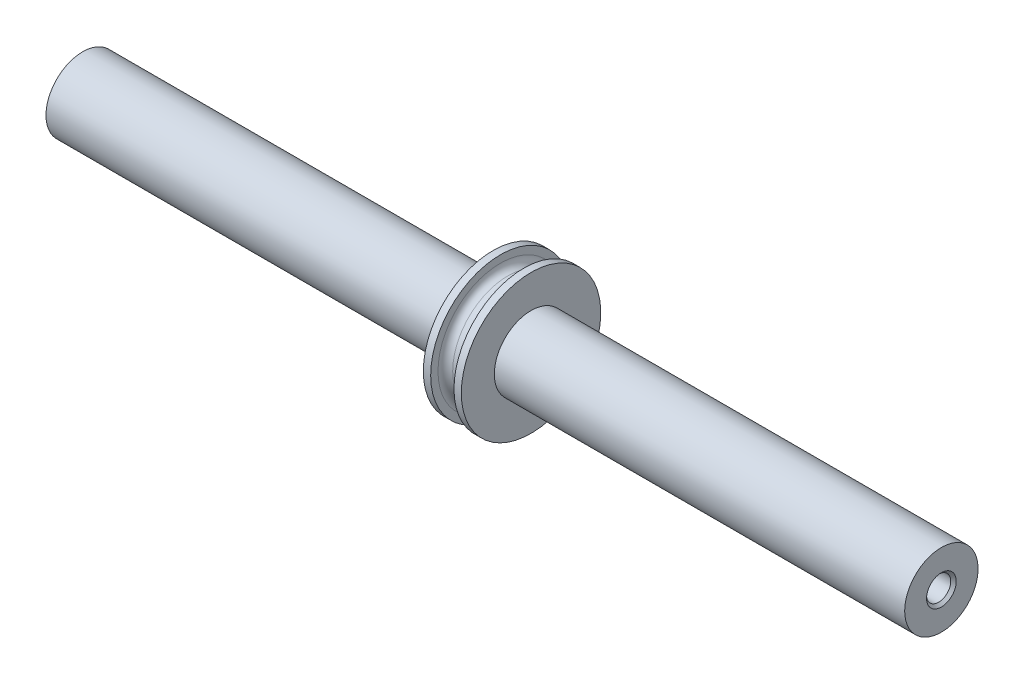
ISO-10303-21;
HEADER;
FILE_DESCRIPTION(('STEP AP214'),'2;1');
FILE_NAME('part.step','',(''),(''),'','','');
FILE_SCHEMA(('AUTOMOTIVE_DESIGN { 1 0 10303 214 1 1 1 1 }'));
ENDSEC;
DATA;
#1=APPLICATION_CONTEXT('core data for automotive mechanical design processes');
#2=APPLICATION_PROTOCOL_DEFINITION('international standard','automotive_design',2000,#1);
#3=PRODUCT_CONTEXT('',#1,'mechanical');
#4=PRODUCT('Part','Part','',(#3));
#5=PRODUCT_RELATED_PRODUCT_CATEGORY('part','',(#4));
#6=PRODUCT_DEFINITION_FORMATION('','',#4);
#7=PRODUCT_DEFINITION_CONTEXT('part definition',#1,'design');
#8=PRODUCT_DEFINITION('design','',#6,#7);
#9=PRODUCT_DEFINITION_SHAPE('','',#8);
#10=(LENGTH_UNIT() NAMED_UNIT(*) SI_UNIT(.MILLI.,.METRE.));
#11=(NAMED_UNIT(*) PLANE_ANGLE_UNIT() SI_UNIT($,.RADIAN.));
#12=(NAMED_UNIT(*) SI_UNIT($,.STERADIAN.) SOLID_ANGLE_UNIT());
#13=UNCERTAINTY_MEASURE_WITH_UNIT(LENGTH_MEASURE(1.E-05),#10,'distance_accuracy_value','');
#14=(GEOMETRIC_REPRESENTATION_CONTEXT(3) GLOBAL_UNCERTAINTY_ASSIGNED_CONTEXT((#13)) GLOBAL_UNIT_ASSIGNED_CONTEXT((#10,
#11,#12)) REPRESENTATION_CONTEXT('',''));
#15=CARTESIAN_POINT('',(0.,0.,0.));
#16=DIRECTION('',(0.,0.,1.));
#17=DIRECTION('',(1.,0.,0.));
#18=AXIS2_PLACEMENT_3D('',#15,#16,#17);
#19=CARTESIAN_POINT('',(-2.5875,0.,0.));
#20=DIRECTION('',(-1.,0.,0.));
#21=DIRECTION('',(0.,0.,1.));
#22=AXIS2_PLACEMENT_3D('',#19,#20,#21);
#23=PLANE('',#22);
#24=CARTESIAN_POINT('',(-2.5875,0.,0.));
#25=DIRECTION('',(-1.,0.,0.));
#26=DIRECTION('',(0.,0.,1.));
#27=AXIS2_PLACEMENT_3D('',#24,#25,#26);
#28=CIRCLE('',#27,9.5);
#29=CARTESIAN_POINT('',(-2.5875,0.,9.5));
#30=VERTEX_POINT('',#29);
#31=EDGE_CURVE('E89',#30,#30,#28,.T.);
#32=ORIENTED_EDGE('',*,*,#31,.T.);
#33=EDGE_LOOP('',(#32));
#34=FACE_BOUND('',#33,.T.);
#35=CARTESIAN_POINT('',(-2.5875,0.,0.));
#36=DIRECTION('',(-1.,0.,0.));
#37=DIRECTION('',(0.,0.,1.));
#38=AXIS2_PLACEMENT_3D('',#35,#36,#37);
#39=CIRCLE('',#38,5.);
#40=CARTESIAN_POINT('',(-2.5875,0.,5.));
#41=VERTEX_POINT('',#40);
#42=EDGE_CURVE('E110',#41,#41,#39,.T.);
#43=ORIENTED_EDGE('',*,*,#42,.F.);
#44=EDGE_LOOP('',(#43));
#45=FACE_BOUND('',#44,.T.);
#46=ADVANCED_FACE('F49',(#34,#45),#23,.T.);
#47=CARTESIAN_POINT('',(-2.64679019420622,0.,0.));
#48=DIRECTION('',(-1.,0.,0.));
#49=DIRECTION('',(0.,0.,1.));
#50=AXIS2_PLACEMENT_3D('',#47,#48,#49);
#51=CYLINDRICAL_SURFACE('',#50,5.);
#52=CARTESIAN_POINT('',(-58.5,0.,0.));
#53=DIRECTION('',(-1.,0.,0.));
#54=DIRECTION('',(0.,0.,1.));
#55=AXIS2_PLACEMENT_3D('',#52,#53,#54);
#56=CIRCLE('',#55,4.99999999999999);
#57=CARTESIAN_POINT('',(-58.5,0.,4.99999999999999));
#58=VERTEX_POINT('',#57);
#59=EDGE_CURVE('E107',#58,#58,#56,.T.);
#60=ORIENTED_EDGE('',*,*,#59,.F.);
#61=EDGE_LOOP('',(#60));
#62=FACE_BOUND('',#61,.T.);
#63=ORIENTED_EDGE('',*,*,#42,.T.);
#64=EDGE_LOOP('',(#63));
#65=FACE_BOUND('',#64,.T.);
#66=ADVANCED_FACE('F155',(#62,#65),#51,.T.);
#67=CARTESIAN_POINT('',(-58.5,0.,0.));
#68=DIRECTION('',(-1.,0.,0.));
#69=DIRECTION('',(0.,0.,1.));
#70=AXIS2_PLACEMENT_3D('',#67,#68,#69);
#71=PLANE('',#70);
#72=CARTESIAN_POINT('',(-58.5,0.,0.));
#73=DIRECTION('',(-1.,0.,0.));
#74=DIRECTION('',(0.,0.,1.));
#75=AXIS2_PLACEMENT_3D('',#72,#73,#74);
#76=CIRCLE('',#75,2.025);
#77=CARTESIAN_POINT('',(-58.5,0.,2.025));
#78=VERTEX_POINT('',#77);
#79=EDGE_CURVE('E73',#78,#78,#76,.T.);
#80=ORIENTED_EDGE('',*,*,#79,.F.);
#81=EDGE_LOOP('',(#80));
#82=FACE_BOUND('',#81,.T.);
#83=ORIENTED_EDGE('',*,*,#59,.T.);
#84=EDGE_LOOP('',(#83));
#85=FACE_BOUND('',#84,.T.);
#86=ADVANCED_FACE('F161',(#82,#85),#71,.T.);
#87=CARTESIAN_POINT('',(58.5,0.,0.));
#88=DIRECTION('',(-1.,0.,0.));
#89=DIRECTION('',(0.,0.,1.));
#90=AXIS2_PLACEMENT_3D('',#87,#88,#89);
#91=PLANE('',#90);
#92=CARTESIAN_POINT('',(58.5,0.,0.));
#93=DIRECTION('',(-1.,0.,0.));
#94=DIRECTION('',(0.,0.,1.));
#95=AXIS2_PLACEMENT_3D('',#92,#93,#94);
#96=CIRCLE('',#95,2.025);
#97=CARTESIAN_POINT('',(58.5,0.,2.025));
#98=VERTEX_POINT('',#97);
#99=EDGE_CURVE('E80',#98,#98,#96,.T.);
#100=ORIENTED_EDGE('',*,*,#99,.T.);
#101=EDGE_LOOP('',(#100));
#102=FACE_BOUND('',#101,.T.);
#103=CARTESIAN_POINT('',(58.5,0.,0.));
#104=DIRECTION('',(-1.,0.,0.));
#105=DIRECTION('',(0.,0.,1.));
#106=AXIS2_PLACEMENT_3D('',#103,#104,#105);
#107=CIRCLE('',#106,4.99999999999999);
#108=CARTESIAN_POINT('',(58.5,0.,4.99999999999999));
#109=VERTEX_POINT('',#108);
#110=EDGE_CURVE('E104',#109,#109,#107,.T.);
#111=ORIENTED_EDGE('',*,*,#110,.F.);
#112=EDGE_LOOP('',(#111));
#113=FACE_BOUND('',#112,.T.);
#114=ADVANCED_FACE('F168',(#102,#113),#91,.F.);
#115=CARTESIAN_POINT('',(-2.64679019420622,0.,0.));
#116=DIRECTION('',(-1.,0.,0.));
#117=DIRECTION('',(0.,0.,1.));
#118=AXIS2_PLACEMENT_3D('',#115,#116,#117);
#119=CYLINDRICAL_SURFACE('',#118,4.99999999999999);
#120=ORIENTED_EDGE('',*,*,#110,.T.);
#121=EDGE_LOOP('',(#120));
#122=FACE_BOUND('',#121,.T.);
#123=CARTESIAN_POINT('',(2.5875,0.,0.));
#124=DIRECTION('',(-1.,0.,0.));
#125=DIRECTION('',(0.,0.,1.));
#126=AXIS2_PLACEMENT_3D('',#123,#124,#125);
#127=CIRCLE('',#126,5.);
#128=CARTESIAN_POINT('',(2.5875,0.,5.));
#129=VERTEX_POINT('',#128);
#130=EDGE_CURVE('E101',#129,#129,#127,.T.);
#131=ORIENTED_EDGE('',*,*,#130,.F.);
#132=EDGE_LOOP('',(#131));
#133=FACE_BOUND('',#132,.T.);
#134=ADVANCED_FACE('F172',(#122,#133),#119,.T.);
#135=CARTESIAN_POINT('',(2.5875,0.,0.));
#136=DIRECTION('',(-1.,0.,0.));
#137=DIRECTION('',(0.,0.,1.));
#138=AXIS2_PLACEMENT_3D('',#135,#136,#137);
#139=PLANE('',#138);
#140=CARTESIAN_POINT('',(2.5875,0.,0.));
#141=DIRECTION('',(-1.,0.,0.));
#142=DIRECTION('',(0.,0.,1.));
#143=AXIS2_PLACEMENT_3D('',#140,#141,#142);
#144=CIRCLE('',#143,9.5);
#145=CARTESIAN_POINT('',(2.5875,0.,9.5));
#146=VERTEX_POINT('',#145);
#147=EDGE_CURVE('E98',#146,#146,#144,.T.);
#148=ORIENTED_EDGE('',*,*,#147,.F.);
#149=EDGE_LOOP('',(#148));
#150=FACE_BOUND('',#149,.T.);
#151=ORIENTED_EDGE('',*,*,#130,.T.);
#152=EDGE_LOOP('',(#151));
#153=FACE_BOUND('',#152,.T.);
#154=ADVANCED_FACE('F176',(#150,#153),#139,.F.);
#155=CARTESIAN_POINT('',(-2.64679019420622,0.,0.));
#156=DIRECTION('',(-1.,0.,0.));
#157=DIRECTION('',(0.,0.,1.));
#158=AXIS2_PLACEMENT_3D('',#155,#156,#157);
#159=CYLINDRICAL_SURFACE('',#158,9.5);
#160=ORIENTED_EDGE('',*,*,#147,.T.);
#161=EDGE_LOOP('',(#160));
#162=FACE_BOUND('',#161,.T.);
#163=CARTESIAN_POINT('',(1.5875,0.,0.));
#164=DIRECTION('',(-1.,0.,0.));
#165=DIRECTION('',(0.,0.,1.));
#166=AXIS2_PLACEMENT_3D('',#163,#164,#165);
#167=CIRCLE('',#166,9.5);
#168=CARTESIAN_POINT('',(1.5875,0.,9.5));
#169=VERTEX_POINT('',#168);
#170=EDGE_CURVE('E95',#169,#169,#167,.T.);
#171=ORIENTED_EDGE('',*,*,#170,.F.);
#172=EDGE_LOOP('',(#171));
#173=FACE_BOUND('',#172,.T.);
#174=ADVANCED_FACE('F180',(#162,#173),#159,.T.);
#175=CARTESIAN_POINT('',(1.5875,0.,0.));
#176=DIRECTION('',(-1.,0.,0.));
#177=DIRECTION('',(0.,0.,1.));
#178=AXIS2_PLACEMENT_3D('',#175,#176,#177);
#179=PLANE('',#178);
#180=CARTESIAN_POINT('',(1.5875,0.,0.));
#181=DIRECTION('',(-1.,0.,0.));
#182=DIRECTION('',(0.,0.,1.));
#183=AXIS2_PLACEMENT_3D('',#180,#181,#182);
#184=CIRCLE('',#183,8.5);
#185=CARTESIAN_POINT('',(1.5875,0.,8.5));
#186=VERTEX_POINT('',#185);
#187=EDGE_CURVE('E57',#186,#186,#184,.F.);
#188=ORIENTED_EDGE('',*,*,#187,.T.);
#189=EDGE_LOOP('',(#188));
#190=FACE_BOUND('',#189,.T.);
#191=ORIENTED_EDGE('',*,*,#170,.T.);
#192=EDGE_LOOP('',(#191));
#193=FACE_BOUND('',#192,.T.);
#194=ADVANCED_FACE('F121',(#190,#193),#179,.T.);
#195=CARTESIAN_POINT('',(-2.64679019420622,0.,0.));
#196=DIRECTION('',(-1.,0.,0.));
#197=DIRECTION('',(0.,0.,1.));
#198=AXIS2_PLACEMENT_3D('',#195,#196,#197);
#199=CYLINDRICAL_SURFACE('',#198,7.5);
#200=CARTESIAN_POINT('',(0.5875,0.,0.));
#201=DIRECTION('',(-1.,0.,0.));
#202=DIRECTION('',(0.,0.,1.));
#203=AXIS2_PLACEMENT_3D('',#200,#201,#202);
#204=CIRCLE('',#203,7.5);
#205=CARTESIAN_POINT('',(0.5875,0.,7.5));
#206=VERTEX_POINT('',#205);
#207=EDGE_CURVE('E116',#206,#206,#204,.T.);
#208=ORIENTED_EDGE('',*,*,#207,.T.);
#209=EDGE_LOOP('',(#208));
#210=FACE_BOUND('',#209,.T.);
#211=CARTESIAN_POINT('',(-0.5875,0.,0.));
#212=DIRECTION('',(-1.,0.,0.));
#213=DIRECTION('',(0.,0.,1.));
#214=AXIS2_PLACEMENT_3D('',#211,#212,#213);
#215=CIRCLE('',#214,7.5);
#216=CARTESIAN_POINT('',(-0.5875,0.,7.5));
#217=VERTEX_POINT('',#216);
#218=EDGE_CURVE('E113',#217,#217,#215,.F.);
#219=ORIENTED_EDGE('',*,*,#218,.T.);
#220=EDGE_LOOP('',(#219));
#221=FACE_BOUND('',#220,.T.);
#222=ADVANCED_FACE('F130',(#210,#221),#199,.T.);
#223=CARTESIAN_POINT('',(-1.5875,0.,0.));
#224=DIRECTION('',(-1.,0.,0.));
#225=DIRECTION('',(0.,0.,1.));
#226=AXIS2_PLACEMENT_3D('',#223,#224,#225);
#227=PLANE('',#226);
#228=CARTESIAN_POINT('',(-1.5875,0.,0.));
#229=DIRECTION('',(-1.,0.,0.));
#230=DIRECTION('',(0.,0.,1.));
#231=AXIS2_PLACEMENT_3D('',#228,#229,#230);
#232=CIRCLE('',#231,8.5);
#233=CARTESIAN_POINT('',(-1.5875,0.,8.5));
#234=VERTEX_POINT('',#233);
#235=EDGE_CURVE('E11',#234,#234,#232,.T.);
#236=ORIENTED_EDGE('',*,*,#235,.T.);
#237=EDGE_LOOP('',(#236));
#238=FACE_BOUND('',#237,.T.);
#239=CARTESIAN_POINT('',(-1.5875,0.,0.));
#240=DIRECTION('',(-1.,0.,0.));
#241=DIRECTION('',(0.,0.,1.));
#242=AXIS2_PLACEMENT_3D('',#239,#240,#241);
#243=CIRCLE('',#242,9.5);
#244=CARTESIAN_POINT('',(-1.5875,0.,9.5));
#245=VERTEX_POINT('',#244);
#246=EDGE_CURVE('E92',#245,#245,#243,.T.);
#247=ORIENTED_EDGE('',*,*,#246,.F.);
#248=EDGE_LOOP('',(#247));
#249=FACE_BOUND('',#248,.T.);
#250=ADVANCED_FACE('F133',(#238,#249),#227,.F.);
#251=CARTESIAN_POINT('',(-2.64679019420622,0.,0.));
#252=DIRECTION('',(-1.,0.,0.));
#253=DIRECTION('',(0.,0.,1.));
#254=AXIS2_PLACEMENT_3D('',#251,#252,#253);
#255=CYLINDRICAL_SURFACE('',#254,9.5);
#256=ORIENTED_EDGE('',*,*,#31,.F.);
#257=EDGE_LOOP('',(#256));
#258=FACE_BOUND('',#257,.T.);
#259=ORIENTED_EDGE('',*,*,#246,.T.);
#260=EDGE_LOOP('',(#259));
#261=FACE_BOUND('',#260,.T.);
#262=ADVANCED_FACE('F127',(#258,#261),#255,.T.);
#263=CARTESIAN_POINT('',(0.5875,0.,0.));
#264=DIRECTION('',(-1.,0.,0.));
#265=DIRECTION('',(0.,0.,1.));
#266=AXIS2_PLACEMENT_3D('',#263,#264,#265);
#267=TOROIDAL_SURFACE('',#266,8.5,1.);
#268=ORIENTED_EDGE('',*,*,#187,.F.);
#269=EDGE_LOOP('',(#268));
#270=FACE_BOUND('',#269,.T.);
#271=ORIENTED_EDGE('',*,*,#207,.F.);
#272=EDGE_LOOP('',(#271));
#273=FACE_BOUND('',#272,.T.);
#274=ADVANCED_FACE('F124',(#270,#273),#267,.F.);
#275=CARTESIAN_POINT('',(-0.5875,0.,0.));
#276=DIRECTION('',(-1.,0.,0.));
#277=DIRECTION('',(0.,0.,1.));
#278=AXIS2_PLACEMENT_3D('',#275,#276,#277);
#279=TOROIDAL_SURFACE('',#278,8.5,1.);
#280=ORIENTED_EDGE('',*,*,#218,.F.);
#281=EDGE_LOOP('',(#280));
#282=FACE_BOUND('',#281,.T.);
#283=ORIENTED_EDGE('',*,*,#235,.F.);
#284=EDGE_LOOP('',(#283));
#285=FACE_BOUND('',#284,.T.);
#286=ADVANCED_FACE('F51',(#282,#285),#279,.F.);
#287=CARTESIAN_POINT('',(-43.5,0.,0.));
#288=DIRECTION('',(-1.,0.,0.));
#289=DIRECTION('',(0.,0.,1.));
#290=AXIS2_PLACEMENT_3D('',#287,#288,#289);
#291=CONICAL_SURFACE('',#290,1.65,1.02974425867665);
#292=CARTESIAN_POINT('',(-42.5085799786045,0.,0.));
#293=VERTEX_POINT('',#292);
#294=VERTEX_LOOP('',#293);
#295=FACE_BOUND('',#294,.T.);
#296=CARTESIAN_POINT('',(-43.5,0.,0.));
#297=DIRECTION('',(-1.,0.,0.));
#298=DIRECTION('',(0.,0.,1.));
#299=AXIS2_PLACEMENT_3D('',#296,#297,#298);
#300=CIRCLE('',#299,1.65);
#301=CARTESIAN_POINT('',(-43.5,0.,1.65));
#302=VERTEX_POINT('',#301);
#303=EDGE_CURVE('E86',#302,#302,#300,.T.);
#304=ORIENTED_EDGE('',*,*,#303,.T.);
#305=EDGE_LOOP('',(#304));
#306=FACE_BOUND('',#305,.T.);
#307=ADVANCED_FACE('F139',(#295,#306),#291,.F.);
#308=CARTESIAN_POINT('',(-58.5,0.,0.));
#309=DIRECTION('',(-1.,0.,0.));
#310=DIRECTION('',(0.,0.,1.));
#311=AXIS2_PLACEMENT_3D('',#308,#309,#310);
#312=CYLINDRICAL_SURFACE('',#311,1.65);
#313=ORIENTED_EDGE('',*,*,#303,.F.);
#314=EDGE_LOOP('',(#313));
#315=FACE_BOUND('',#314,.T.);
#316=CARTESIAN_POINT('',(-58.125,0.,0.));
#317=DIRECTION('',(-1.,0.,0.));
#318=DIRECTION('',(0.,0.,1.));
#319=AXIS2_PLACEMENT_3D('',#316,#317,#318);
#320=CIRCLE('',#319,1.65);
#321=CARTESIAN_POINT('',(-58.125,0.,1.65));
#322=VERTEX_POINT('',#321);
#323=EDGE_CURVE('E77',#322,#322,#320,.T.);
#324=ORIENTED_EDGE('',*,*,#323,.T.);
#325=EDGE_LOOP('',(#324));
#326=FACE_BOUND('',#325,.T.);
#327=ADVANCED_FACE('F235',(#315,#326),#312,.F.);
#328=CARTESIAN_POINT('',(-58.5,0.,0.));
#329=DIRECTION('',(-1.,0.,0.));
#330=DIRECTION('',(0.,0.,1.));
#331=AXIS2_PLACEMENT_3D('',#328,#329,#330);
#332=CONICAL_SURFACE('',#331,2.025,0.78539816339745);
#333=ORIENTED_EDGE('',*,*,#323,.F.);
#334=EDGE_LOOP('',(#333));
#335=FACE_BOUND('',#334,.T.);
#336=ORIENTED_EDGE('',*,*,#79,.T.);
#337=EDGE_LOOP('',(#336));
#338=FACE_BOUND('',#337,.T.);
#339=ADVANCED_FACE('F67',(#335,#338),#332,.F.);
#340=CARTESIAN_POINT('',(43.5,0.,0.));
#341=DIRECTION('',(1.,0.,0.));
#342=DIRECTION('',(0.,0.,1.));
#343=AXIS2_PLACEMENT_3D('',#340,#341,#342);
#344=CONICAL_SURFACE('',#343,1.65,1.02974425867665);
#345=CARTESIAN_POINT('',(42.5085799786045,0.,0.));
#346=VERTEX_POINT('',#345);
#347=VERTEX_LOOP('',#346);
#348=FACE_BOUND('',#347,.T.);
#349=CARTESIAN_POINT('',(43.5,0.,0.));
#350=DIRECTION('',(-1.,0.,0.));
#351=DIRECTION('',(0.,0.,1.));
#352=AXIS2_PLACEMENT_3D('',#349,#350,#351);
#353=CIRCLE('',#352,1.65);
#354=CARTESIAN_POINT('',(43.5,0.,1.65));
#355=VERTEX_POINT('',#354);
#356=EDGE_CURVE('E71',#355,#355,#353,.T.);
#357=ORIENTED_EDGE('',*,*,#356,.F.);
#358=EDGE_LOOP('',(#357));
#359=FACE_BOUND('',#358,.T.);
#360=ADVANCED_FACE('F63',(#348,#359),#344,.F.);
#361=CARTESIAN_POINT('',(58.5,0.,0.));
#362=DIRECTION('',(1.,0.,0.));
#363=DIRECTION('',(0.,0.,1.));
#364=AXIS2_PLACEMENT_3D('',#361,#362,#363);
#365=CYLINDRICAL_SURFACE('',#364,1.65);
#366=ORIENTED_EDGE('',*,*,#356,.T.);
#367=EDGE_LOOP('',(#366));
#368=FACE_BOUND('',#367,.T.);
#369=CARTESIAN_POINT('',(58.125,0.,0.));
#370=DIRECTION('',(-1.,0.,0.));
#371=DIRECTION('',(0.,0.,1.));
#372=AXIS2_PLACEMENT_3D('',#369,#370,#371);
#373=CIRCLE('',#372,1.65);
#374=CARTESIAN_POINT('',(58.125,0.,1.65));
#375=VERTEX_POINT('',#374);
#376=EDGE_CURVE('E74',#375,#375,#373,.T.);
#377=ORIENTED_EDGE('',*,*,#376,.F.);
#378=EDGE_LOOP('',(#377));
#379=FACE_BOUND('',#378,.T.);
#380=ADVANCED_FACE('F66',(#368,#379),#365,.F.);
#381=CARTESIAN_POINT('',(58.5,0.,0.));
#382=DIRECTION('',(1.,0.,0.));
#383=DIRECTION('',(0.,0.,1.));
#384=AXIS2_PLACEMENT_3D('',#381,#382,#383);
#385=CONICAL_SURFACE('',#384,2.025,0.78539816339745);
#386=ORIENTED_EDGE('',*,*,#376,.T.);
#387=EDGE_LOOP('',(#386));
#388=FACE_BOUND('',#387,.T.);
#389=ORIENTED_EDGE('',*,*,#99,.F.);
#390=EDGE_LOOP('',(#389));
#391=FACE_BOUND('',#390,.T.);
#392=ADVANCED_FACE('F284',(#388,#391),#385,.F.);
#393=CLOSED_SHELL('',(#46,#66,#86,#114,#134,#154,#174,#194,#222,#250,#262,#274,#286,#307,#327,
#339,#360,#380,#392));
#394=MANIFOLD_SOLID_BREP('B2',#393);
#395=ADVANCED_BREP_SHAPE_REPRESENTATION('',(#18,#394),#14);
#396=SHAPE_DEFINITION_REPRESENTATION(#9,#395);
ENDSEC;
END-ISO-10303-21;
